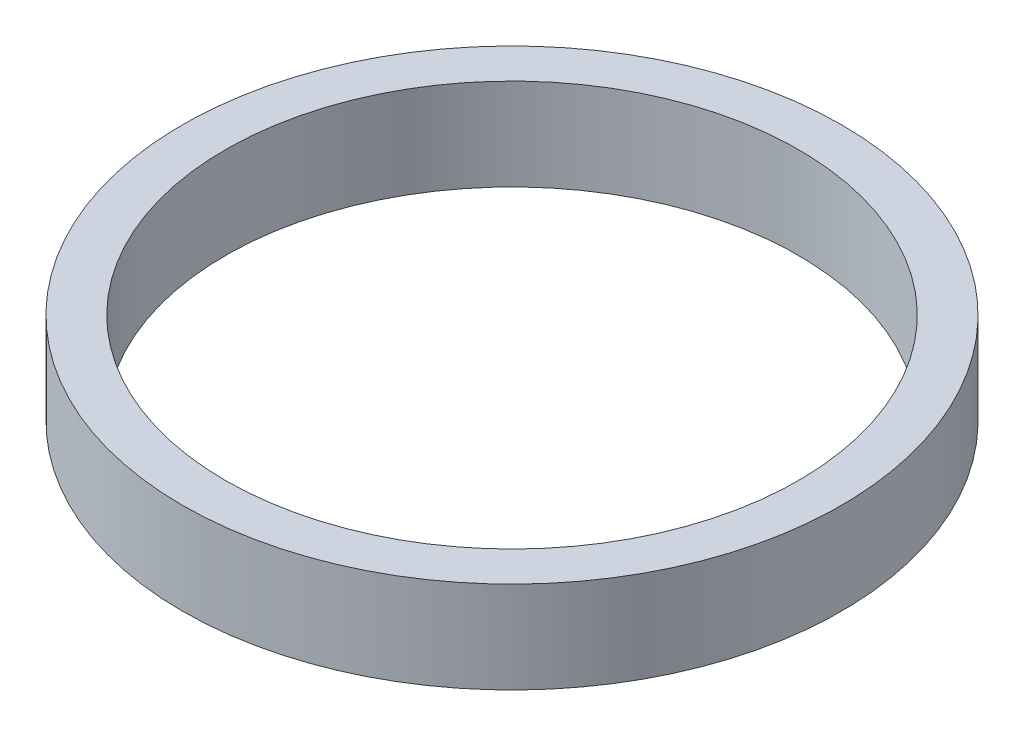
ISO-10303-21;
HEADER;
FILE_DESCRIPTION(('STEP AP214'),'2;1');
FILE_NAME('part.step','',(''),(''),'','','');
FILE_SCHEMA(('AUTOMOTIVE_DESIGN { 1 0 10303 214 1 1 1 1 }'));
ENDSEC;
DATA;
#1=APPLICATION_CONTEXT('core data for automotive mechanical design processes');
#2=APPLICATION_PROTOCOL_DEFINITION('international standard','automotive_design',2000,#1);
#3=PRODUCT_CONTEXT('',#1,'mechanical');
#4=PRODUCT('Part','Part','',(#3));
#5=PRODUCT_RELATED_PRODUCT_CATEGORY('part','',(#4));
#6=PRODUCT_DEFINITION_FORMATION('','',#4);
#7=PRODUCT_DEFINITION_CONTEXT('part definition',#1,'design');
#8=PRODUCT_DEFINITION('design','',#6,#7);
#9=PRODUCT_DEFINITION_SHAPE('','',#8);
#10=(LENGTH_UNIT() NAMED_UNIT(*) SI_UNIT(.MILLI.,.METRE.));
#11=(NAMED_UNIT(*) PLANE_ANGLE_UNIT() SI_UNIT($,.RADIAN.));
#12=(NAMED_UNIT(*) SI_UNIT($,.STERADIAN.) SOLID_ANGLE_UNIT());
#13=UNCERTAINTY_MEASURE_WITH_UNIT(LENGTH_MEASURE(1.E-05),#10,'distance_accuracy_value','');
#14=(GEOMETRIC_REPRESENTATION_CONTEXT(3) GLOBAL_UNCERTAINTY_ASSIGNED_CONTEXT((#13)) GLOBAL_UNIT_ASSIGNED_CONTEXT((#10,
#11,#12)) REPRESENTATION_CONTEXT('',''));
#15=CARTESIAN_POINT('',(0.,0.,0.));
#16=DIRECTION('',(0.,0.,1.));
#17=DIRECTION('',(1.,0.,0.));
#18=AXIS2_PLACEMENT_3D('',#15,#16,#17);
#19=CARTESIAN_POINT('',(0.,16.,0.));
#20=DIRECTION('',(0.,-1.,0.));
#21=DIRECTION('',(0.,0.,-1.));
#22=AXIS2_PLACEMENT_3D('',#19,#20,#21);
#23=CYLINDRICAL_SURFACE('',#22,57.5);
#24=CARTESIAN_POINT('',(0.,16.,0.));
#25=DIRECTION('',(0.,1.,0.));
#26=DIRECTION('',(0.,0.,1.));
#27=AXIS2_PLACEMENT_3D('',#24,#25,#26);
#28=CIRCLE('',#27,57.5);
#29=CARTESIAN_POINT('',(0.,16.,57.5));
#30=VERTEX_POINT('',#29);
#31=EDGE_CURVE('E10',#30,#30,#28,.T.);
#32=ORIENTED_EDGE('',*,*,#31,.F.);
#33=EDGE_LOOP('',(#32));
#34=FACE_BOUND('',#33,.T.);
#35=CARTESIAN_POINT('',(0.,0.,0.));
#36=DIRECTION('',(0.,1.,0.));
#37=DIRECTION('',(0.,0.,1.));
#38=AXIS2_PLACEMENT_3D('',#35,#36,#37);
#39=CIRCLE('',#38,57.5);
#40=CARTESIAN_POINT('',(0.,0.,57.5));
#41=VERTEX_POINT('',#40);
#42=EDGE_CURVE('E37',#41,#41,#39,.T.);
#43=ORIENTED_EDGE('',*,*,#42,.T.);
#44=EDGE_LOOP('',(#43));
#45=FACE_BOUND('',#44,.T.);
#46=ADVANCED_FACE('F40',(#34,#45),#23,.T.);
#47=CARTESIAN_POINT('',(0.,16.,0.));
#48=DIRECTION('',(0.,1.,0.));
#49=DIRECTION('',(0.,0.,1.));
#50=AXIS2_PLACEMENT_3D('',#47,#48,#49);
#51=PLANE('',#50);
#52=CARTESIAN_POINT('',(0.,16.,0.));
#53=DIRECTION('',(0.,1.,0.));
#54=DIRECTION('',(0.,0.,1.));
#55=AXIS2_PLACEMENT_3D('',#52,#53,#54);
#56=CIRCLE('',#55,50.);
#57=CARTESIAN_POINT('',(0.,16.,50.));
#58=VERTEX_POINT('',#57);
#59=EDGE_CURVE('E50',#58,#58,#56,.T.);
#60=ORIENTED_EDGE('',*,*,#59,.F.);
#61=EDGE_LOOP('',(#60));
#62=FACE_BOUND('',#61,.T.);
#63=ORIENTED_EDGE('',*,*,#31,.T.);
#64=EDGE_LOOP('',(#63));
#65=FACE_BOUND('',#64,.T.);
#66=ADVANCED_FACE('F59',(#62,#65),#51,.T.);
#67=CARTESIAN_POINT('',(0.,0.,0.));
#68=DIRECTION('',(0.,1.,0.));
#69=DIRECTION('',(0.,0.,1.));
#70=AXIS2_PLACEMENT_3D('',#67,#68,#69);
#71=PLANE('',#70);
#72=CARTESIAN_POINT('',(0.,0.,0.));
#73=DIRECTION('',(0.,1.,0.));
#74=DIRECTION('',(0.,0.,1.));
#75=AXIS2_PLACEMENT_3D('',#72,#73,#74);
#76=CIRCLE('',#75,50.);
#77=CARTESIAN_POINT('',(0.,0.,50.));
#78=VERTEX_POINT('',#77);
#79=EDGE_CURVE('E47',#78,#78,#76,.T.);
#80=ORIENTED_EDGE('',*,*,#79,.T.);
#81=EDGE_LOOP('',(#80));
#82=FACE_BOUND('',#81,.T.);
#83=ORIENTED_EDGE('',*,*,#42,.F.);
#84=EDGE_LOOP('',(#83));
#85=FACE_BOUND('',#84,.T.);
#86=ADVANCED_FACE('F58',(#82,#85),#71,.F.);
#87=CARTESIAN_POINT('',(0.,16.,0.));
#88=DIRECTION('',(0.,-1.,0.));
#89=DIRECTION('',(0.,0.,-1.));
#90=AXIS2_PLACEMENT_3D('',#87,#88,#89);
#91=CYLINDRICAL_SURFACE('',#90,50.);
#92=ORIENTED_EDGE('',*,*,#59,.T.);
#93=EDGE_LOOP('',(#92));
#94=FACE_BOUND('',#93,.T.);
#95=ORIENTED_EDGE('',*,*,#79,.F.);
#96=EDGE_LOOP('',(#95));
#97=FACE_BOUND('',#96,.T.);
#98=ADVANCED_FACE('F54',(#94,#97),#91,.F.);
#99=CLOSED_SHELL('',(#46,#66,#86,#98));
#100=MANIFOLD_SOLID_BREP('B2',#99);
#101=ADVANCED_BREP_SHAPE_REPRESENTATION('',(#18,#100),#14);
#102=SHAPE_DEFINITION_REPRESENTATION(#9,#101);
ENDSEC;
END-ISO-10303-21;
